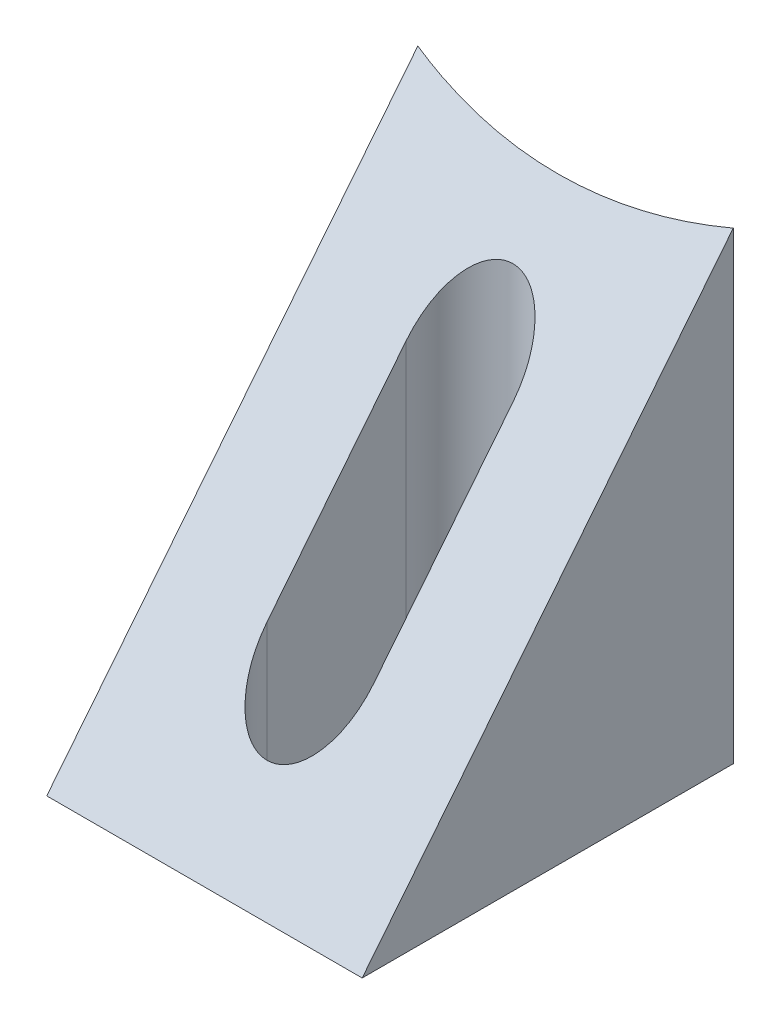
ISO-10303-21;
HEADER;
FILE_DESCRIPTION(('STEP AP214'),'2;1');
FILE_NAME('part.step','',(''),(''),'','','');
FILE_SCHEMA(('AUTOMOTIVE_DESIGN { 1 0 10303 214 1 1 1 1 }'));
ENDSEC;
DATA;
#1=APPLICATION_CONTEXT('core data for automotive mechanical design processes');
#2=APPLICATION_PROTOCOL_DEFINITION('international standard','automotive_design',2000,#1);
#3=PRODUCT_CONTEXT('',#1,'mechanical');
#4=PRODUCT('Part','Part','',(#3));
#5=PRODUCT_RELATED_PRODUCT_CATEGORY('part','',(#4));
#6=PRODUCT_DEFINITION_FORMATION('','',#4);
#7=PRODUCT_DEFINITION_CONTEXT('part definition',#1,'design');
#8=PRODUCT_DEFINITION('design','',#6,#7);
#9=PRODUCT_DEFINITION_SHAPE('','',#8);
#10=(LENGTH_UNIT() NAMED_UNIT(*) SI_UNIT(.MILLI.,.METRE.));
#11=(NAMED_UNIT(*) PLANE_ANGLE_UNIT() SI_UNIT($,.RADIAN.));
#12=(NAMED_UNIT(*) SI_UNIT($,.STERADIAN.) SOLID_ANGLE_UNIT());
#13=UNCERTAINTY_MEASURE_WITH_UNIT(LENGTH_MEASURE(1.E-05),#10,'distance_accuracy_value','');
#14=(GEOMETRIC_REPRESENTATION_CONTEXT(3) GLOBAL_UNCERTAINTY_ASSIGNED_CONTEXT((#13)) GLOBAL_UNIT_ASSIGNED_CONTEXT((#10,
#11,#12)) REPRESENTATION_CONTEXT('',''));
#15=CARTESIAN_POINT('',(0.,0.,0.));
#16=DIRECTION('',(0.,0.,1.));
#17=DIRECTION('',(1.,0.,0.));
#18=AXIS2_PLACEMENT_3D('',#15,#16,#17);
#19=CARTESIAN_POINT('',(3.4,10.,-4.));
#20=DIRECTION('',(-1.,0.,0.));
#21=DIRECTION('',(0.,0.,1.));
#22=AXIS2_PLACEMENT_3D('',#19,#20,#21);
#23=PLANE('',#22);
#24=DIRECTION('',(0.,-1.,0.));
#25=VECTOR('',#24,1.);
#26=CARTESIAN_POINT('',(3.4,10.,-4.));
#27=LINE('',#26,#25);
#28=CARTESIAN_POINT('',(3.4,10.,-4.));
#29=VERTEX_POINT('',#28);
#30=CARTESIAN_POINT('',(3.40000000000001,0.,-4.));
#31=VERTEX_POINT('',#30);
#32=EDGE_CURVE('E91',#29,#31,#27,.T.);
#33=ORIENTED_EDGE('',*,*,#32,.F.);
#34=DIRECTION('',(0.,0.78086880944303,-0.624695047554424));
#35=VECTOR('',#34,1.);
#36=CARTESIAN_POINT('',(3.4,10.,-4.));
#37=LINE('',#36,#35);
#38=CARTESIAN_POINT('',(3.4,0.,4.));
#39=VERTEX_POINT('',#38);
#40=EDGE_CURVE('E98',#39,#29,#37,.T.);
#41=ORIENTED_EDGE('',*,*,#40,.F.);
#42=DIRECTION('',(0.,0.,-1.));
#43=VECTOR('',#42,1.);
#44=CARTESIAN_POINT('',(3.4,0.,-4.));
#45=LINE('',#44,#43);
#46=EDGE_CURVE('E108',#39,#31,#45,.T.);
#47=ORIENTED_EDGE('',*,*,#46,.T.);
#48=EDGE_LOOP('',(#33,#41,#47));
#49=FACE_BOUND('',#48,.T.);
#50=ADVANCED_FACE('F31',(#49),#23,.F.);
#51=CARTESIAN_POINT('',(-3.4,10.,-4.));
#52=DIRECTION('',(1.,0.,0.));
#53=DIRECTION('',(0.,0.,-1.));
#54=AXIS2_PLACEMENT_3D('',#51,#52,#53);
#55=PLANE('',#54);
#56=DIRECTION('',(0.,0.,1.));
#57=VECTOR('',#56,1.);
#58=CARTESIAN_POINT('',(-3.4,0.,-4.));
#59=LINE('',#58,#57);
#60=CARTESIAN_POINT('',(-3.4,0.,-4.));
#61=VERTEX_POINT('',#60);
#62=CARTESIAN_POINT('',(-3.4,0.,4.));
#63=VERTEX_POINT('',#62);
#64=EDGE_CURVE('E142',#61,#63,#59,.T.);
#65=ORIENTED_EDGE('',*,*,#64,.T.);
#66=DIRECTION('',(0.,0.78086880944303,-0.624695047554424));
#67=VECTOR('',#66,1.);
#68=CARTESIAN_POINT('',(-3.4,10.,-4.));
#69=LINE('',#68,#67);
#70=CARTESIAN_POINT('',(-3.4,10.,-4.));
#71=VERTEX_POINT('',#70);
#72=EDGE_CURVE('E105',#63,#71,#69,.T.);
#73=ORIENTED_EDGE('',*,*,#72,.T.);
#74=DIRECTION('',(0.,-1.,0.));
#75=VECTOR('',#74,1.);
#76=CARTESIAN_POINT('',(-3.4,10.,-4.));
#77=LINE('',#76,#75);
#78=EDGE_CURVE('E94',#71,#61,#77,.T.);
#79=ORIENTED_EDGE('',*,*,#78,.T.);
#80=EDGE_LOOP('',(#65,#73,#79));
#81=FACE_BOUND('',#80,.T.);
#82=ADVANCED_FACE('F146',(#81),#55,.F.);
#83=CARTESIAN_POINT('',(3.4,0.,4.));
#84=DIRECTION('',(0.,1.,0.));
#85=DIRECTION('',(0.,0.,1.));
#86=AXIS2_PLACEMENT_3D('',#83,#84,#85);
#87=PLANE('',#86);
#88=DIRECTION('',(0.,0.,-1.));
#89=VECTOR('',#88,1.);
#90=CARTESIAN_POINT('',(-1.15,0.,1.5));
#91=LINE('',#90,#89);
#92=CARTESIAN_POINT('',(-1.15,0.,1.5));
#93=VERTEX_POINT('',#92);
#94=CARTESIAN_POINT('',(-1.15,0.,-1.5));
#95=VERTEX_POINT('',#94);
#96=EDGE_CURVE('E151',#93,#95,#91,.T.);
#97=ORIENTED_EDGE('',*,*,#96,.F.);
#98=CARTESIAN_POINT('',(0.,0.,1.5));
#99=DIRECTION('',(0.,-1.,0.));
#100=DIRECTION('',(0.,0.,-1.));
#101=AXIS2_PLACEMENT_3D('',#98,#99,#100);
#102=CIRCLE('',#101,1.15);
#103=CARTESIAN_POINT('',(1.15,0.,1.5));
#104=VERTEX_POINT('',#103);
#105=EDGE_CURVE('E45',#104,#93,#102,.T.);
#106=ORIENTED_EDGE('',*,*,#105,.F.);
#107=DIRECTION('',(0.,0.,1.));
#108=VECTOR('',#107,1.);
#109=CARTESIAN_POINT('',(1.15,0.,1.5));
#110=LINE('',#109,#108);
#111=CARTESIAN_POINT('',(1.15,0.,-1.5));
#112=VERTEX_POINT('',#111);
#113=EDGE_CURVE('E131',#112,#104,#110,.T.);
#114=ORIENTED_EDGE('',*,*,#113,.F.);
#115=CARTESIAN_POINT('',(0.,0.,-1.5));
#116=DIRECTION('',(0.,-1.,0.));
#117=DIRECTION('',(0.,0.,-1.));
#118=AXIS2_PLACEMENT_3D('',#115,#116,#117);
#119=CIRCLE('',#118,1.15);
#120=EDGE_CURVE('E154',#95,#112,#119,.T.);
#121=ORIENTED_EDGE('',*,*,#120,.F.);
#122=EDGE_LOOP('',(#97,#106,#114,#121));
#123=FACE_BOUND('',#122,.T.);
#124=ORIENTED_EDGE('',*,*,#64,.F.);
#125=CARTESIAN_POINT('',(0.,0.,-18.6211319671221));
#126=DIRECTION('',(0.,-1.,0.));
#127=DIRECTION('',(0.,0.,-1.));
#128=AXIS2_PLACEMENT_3D('',#125,#126,#127);
#129=CIRCLE('',#128,15.0112457844111);
#130=EDGE_CURVE('E149',#31,#61,#129,.T.);
#131=ORIENTED_EDGE('',*,*,#130,.F.);
#132=ORIENTED_EDGE('',*,*,#46,.F.);
#133=DIRECTION('',(1.,0.,0.));
#134=VECTOR('',#133,1.);
#135=CARTESIAN_POINT('',(-3.4,0.,4.));
#136=LINE('',#135,#134);
#137=EDGE_CURVE('E101',#63,#39,#136,.T.);
#138=ORIENTED_EDGE('',*,*,#137,.F.);
#139=EDGE_LOOP('',(#124,#131,#132,#138));
#140=FACE_BOUND('',#139,.T.);
#141=ADVANCED_FACE('F148',(#123,#140),#87,.F.);
#142=CARTESIAN_POINT('',(-3.4,10.,-4.));
#143=DIRECTION('',(0.,-0.624695047554424,-0.78086880944303));
#144=DIRECTION('',(0.,0.78086880944303,-0.624695047554424));
#145=AXIS2_PLACEMENT_3D('',#142,#143,#144);
#146=PLANE('',#145);
#147=DIRECTION('',(0.,-0.78086880944303,0.624695047554424));
#148=VECTOR('',#147,1.);
#149=CARTESIAN_POINT('',(1.15,10.,-4.));
#150=LINE('',#149,#148);
#151=CARTESIAN_POINT('',(1.15,6.875,-1.5));
#152=VERTEX_POINT('',#151);
#153=CARTESIAN_POINT('',(1.15,3.125,1.5));
#154=VERTEX_POINT('',#153);
#155=EDGE_CURVE('E119',#152,#154,#150,.T.);
#156=ORIENTED_EDGE('',*,*,#155,.T.);
#157=CARTESIAN_POINT('',(0.,3.125,1.5));
#158=DIRECTION('',(0.,-0.624695047554424,-0.78086880944303));
#159=DIRECTION('',(0.,-0.78086880944303,0.624695047554424));
#160=AXIS2_PLACEMENT_3D('',#157,#158,#159);
#161=ELLIPSE('',#160,1.84089821826194,1.15);
#162=CARTESIAN_POINT('',(-1.15,3.125,1.5));
#163=VERTEX_POINT('',#162);
#164=EDGE_CURVE('E38',#154,#163,#161,.T.);
#165=ORIENTED_EDGE('',*,*,#164,.T.);
#166=DIRECTION('',(0.,0.78086880944303,-0.624695047554424));
#167=VECTOR('',#166,1.);
#168=CARTESIAN_POINT('',(-1.15,10.,-4.));
#169=LINE('',#168,#167);
#170=CARTESIAN_POINT('',(-1.15,6.875,-1.5));
#171=VERTEX_POINT('',#170);
#172=EDGE_CURVE('E109',#163,#171,#169,.T.);
#173=ORIENTED_EDGE('',*,*,#172,.T.);
#174=CARTESIAN_POINT('',(0.,6.875,-1.5));
#175=DIRECTION('',(0.,-0.624695047554424,-0.78086880944303));
#176=DIRECTION('',(0.,-0.78086880944303,0.624695047554424));
#177=AXIS2_PLACEMENT_3D('',#174,#175,#176);
#178=ELLIPSE('',#177,1.84089821826194,1.15);
#179=EDGE_CURVE('E112',#171,#152,#178,.T.);
#180=ORIENTED_EDGE('',*,*,#179,.T.);
#181=EDGE_LOOP('',(#156,#165,#173,#180));
#182=FACE_BOUND('',#181,.T.);
#183=ORIENTED_EDGE('',*,*,#40,.T.);
#184=CARTESIAN_POINT('',(0.,28.2764149589026,-18.6211319671221));
#185=DIRECTION('',(0.,-0.624695047554424,-0.78086880944303));
#186=DIRECTION('',(0.,-0.78086880944303,0.624695047554424));
#187=AXIS2_PLACEMENT_3D('',#184,#185,#186);
#188=ELLIPSE('',#187,24.0297179290561,15.0112457844111);
#189=EDGE_CURVE('E11',#29,#71,#188,.T.);
#190=ORIENTED_EDGE('',*,*,#189,.T.);
#191=ORIENTED_EDGE('',*,*,#72,.F.);
#192=ORIENTED_EDGE('',*,*,#137,.T.);
#193=EDGE_LOOP('',(#183,#190,#191,#192));
#194=FACE_BOUND('',#193,.T.);
#195=ADVANCED_FACE('F99',(#182,#194),#146,.F.);
#196=CARTESIAN_POINT('',(0.,10.,1.5));
#197=DIRECTION('',(0.,-1.,0.));
#198=DIRECTION('',(0.,0.,-1.));
#199=AXIS2_PLACEMENT_3D('',#196,#197,#198);
#200=CYLINDRICAL_SURFACE('',#199,1.15);
#201=DIRECTION('',(0.,-1.,0.));
#202=VECTOR('',#201,1.);
#203=CARTESIAN_POINT('',(1.15,10.,1.5));
#204=LINE('',#203,#202);
#205=EDGE_CURVE('E106',#154,#104,#204,.T.);
#206=ORIENTED_EDGE('',*,*,#205,.T.);
#207=ORIENTED_EDGE('',*,*,#105,.T.);
#208=DIRECTION('',(0.,-1.,0.));
#209=VECTOR('',#208,1.);
#210=CARTESIAN_POINT('',(-1.15,10.,1.5));
#211=LINE('',#210,#209);
#212=EDGE_CURVE('E126',#163,#93,#211,.T.);
#213=ORIENTED_EDGE('',*,*,#212,.F.);
#214=ORIENTED_EDGE('',*,*,#164,.F.);
#215=EDGE_LOOP('',(#206,#207,#213,#214));
#216=FACE_BOUND('',#215,.T.);
#217=ADVANCED_FACE('F124',(#216),#200,.F.);
#218=CARTESIAN_POINT('',(1.15,10.,1.5));
#219=DIRECTION('',(1.,0.,0.));
#220=DIRECTION('',(0.,0.,-1.));
#221=AXIS2_PLACEMENT_3D('',#218,#219,#220);
#222=PLANE('',#221);
#223=DIRECTION('',(0.,-1.,0.));
#224=VECTOR('',#223,1.);
#225=CARTESIAN_POINT('',(1.15,10.,-1.5));
#226=LINE('',#225,#224);
#227=EDGE_CURVE('E132',#152,#112,#226,.T.);
#228=ORIENTED_EDGE('',*,*,#227,.T.);
#229=ORIENTED_EDGE('',*,*,#113,.T.);
#230=ORIENTED_EDGE('',*,*,#205,.F.);
#231=ORIENTED_EDGE('',*,*,#155,.F.);
#232=EDGE_LOOP('',(#228,#229,#230,#231));
#233=FACE_BOUND('',#232,.T.);
#234=ADVANCED_FACE('F128',(#233),#222,.F.);
#235=CARTESIAN_POINT('',(0.,10.,-1.5));
#236=DIRECTION('',(0.,-1.,0.));
#237=DIRECTION('',(0.,0.,-1.));
#238=AXIS2_PLACEMENT_3D('',#235,#236,#237);
#239=CYLINDRICAL_SURFACE('',#238,1.15);
#240=DIRECTION('',(0.,-1.,0.));
#241=VECTOR('',#240,1.);
#242=CARTESIAN_POINT('',(-1.15,10.,-1.5));
#243=LINE('',#242,#241);
#244=EDGE_CURVE('E53',#171,#95,#243,.T.);
#245=ORIENTED_EDGE('',*,*,#244,.T.);
#246=ORIENTED_EDGE('',*,*,#120,.T.);
#247=ORIENTED_EDGE('',*,*,#227,.F.);
#248=ORIENTED_EDGE('',*,*,#179,.F.);
#249=EDGE_LOOP('',(#245,#246,#247,#248));
#250=FACE_BOUND('',#249,.T.);
#251=ADVANCED_FACE('F158',(#250),#239,.F.);
#252=CARTESIAN_POINT('',(-1.15,10.,1.5));
#253=DIRECTION('',(-1.,0.,0.));
#254=DIRECTION('',(0.,0.,1.));
#255=AXIS2_PLACEMENT_3D('',#252,#253,#254);
#256=PLANE('',#255);
#257=ORIENTED_EDGE('',*,*,#212,.T.);
#258=ORIENTED_EDGE('',*,*,#96,.T.);
#259=ORIENTED_EDGE('',*,*,#244,.F.);
#260=ORIENTED_EDGE('',*,*,#172,.F.);
#261=EDGE_LOOP('',(#257,#258,#259,#260));
#262=FACE_BOUND('',#261,.T.);
#263=ADVANCED_FACE('F161',(#262),#256,.F.);
#264=CARTESIAN_POINT('',(0.,10.,-18.6211319671221));
#265=DIRECTION('',(0.,-1.,0.));
#266=DIRECTION('',(0.,0.,-1.));
#267=AXIS2_PLACEMENT_3D('',#264,#265,#266);
#268=CYLINDRICAL_SURFACE('',#267,15.0112457844111);
#269=ORIENTED_EDGE('',*,*,#130,.T.);
#270=ORIENTED_EDGE('',*,*,#78,.F.);
#271=ORIENTED_EDGE('',*,*,#189,.F.);
#272=ORIENTED_EDGE('',*,*,#32,.T.);
#273=EDGE_LOOP('',(#269,#270,#271,#272));
#274=FACE_BOUND('',#273,.T.);
#275=ADVANCED_FACE('F89',(#274),#268,.F.);
#276=CLOSED_SHELL('',(#50,#82,#141,#195,#217,#234,#251,#263,#275));
#277=MANIFOLD_SOLID_BREP('B2',#276);
#278=ADVANCED_BREP_SHAPE_REPRESENTATION('',(#18,#277),#14);
#279=SHAPE_DEFINITION_REPRESENTATION(#9,#278);
ENDSEC;
END-ISO-10303-21;
